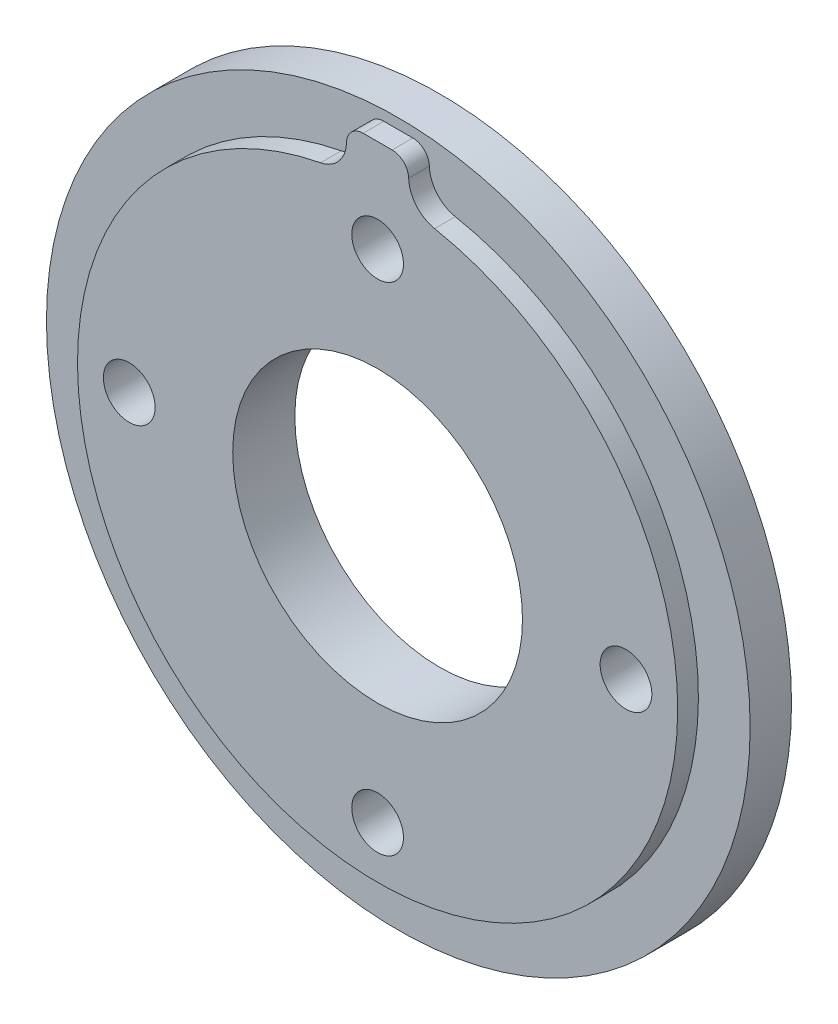
ISO-10303-21;
HEADER;
FILE_DESCRIPTION(('STEP AP214'),'2;1');
FILE_NAME('part.step','',(''),(''),'','','');
FILE_SCHEMA(('AUTOMOTIVE_DESIGN { 1 0 10303 214 1 1 1 1 }'));
ENDSEC;
DATA;
#1=APPLICATION_CONTEXT('core data for automotive mechanical design processes');
#2=APPLICATION_PROTOCOL_DEFINITION('international standard','automotive_design',2000,#1);
#3=PRODUCT_CONTEXT('',#1,'mechanical');
#4=PRODUCT('Part','Part','',(#3));
#5=PRODUCT_RELATED_PRODUCT_CATEGORY('part','',(#4));
#6=PRODUCT_DEFINITION_FORMATION('','',#4);
#7=PRODUCT_DEFINITION_CONTEXT('part definition',#1,'design');
#8=PRODUCT_DEFINITION('design','',#6,#7);
#9=PRODUCT_DEFINITION_SHAPE('','',#8);
#10=(LENGTH_UNIT() NAMED_UNIT(*) SI_UNIT(.MILLI.,.METRE.));
#11=(NAMED_UNIT(*) PLANE_ANGLE_UNIT() SI_UNIT($,.RADIAN.));
#12=(NAMED_UNIT(*) SI_UNIT($,.STERADIAN.) SOLID_ANGLE_UNIT());
#13=UNCERTAINTY_MEASURE_WITH_UNIT(LENGTH_MEASURE(1.E-05),#10,'distance_accuracy_value','');
#14=(GEOMETRIC_REPRESENTATION_CONTEXT(3) GLOBAL_UNCERTAINTY_ASSIGNED_CONTEXT((#13)) GLOBAL_UNIT_ASSIGNED_CONTEXT((#10,
#11,#12)) REPRESENTATION_CONTEXT('',''));
#15=CARTESIAN_POINT('',(0.,0.,0.));
#16=DIRECTION('',(0.,0.,1.));
#17=DIRECTION('',(1.,0.,0.));
#18=AXIS2_PLACEMENT_3D('',#15,#16,#17);
#19=CARTESIAN_POINT('',(0.,0.,2.));
#20=DIRECTION('',(0.,0.,-1.));
#21=DIRECTION('',(-1.,0.,0.));
#22=AXIS2_PLACEMENT_3D('',#19,#20,#21);
#23=CYLINDRICAL_SURFACE('',#22,17.);
#24=CARTESIAN_POINT('',(0.,0.,2.));
#25=DIRECTION('',(0.,0.,1.));
#26=DIRECTION('',(1.,0.,0.));
#27=AXIS2_PLACEMENT_3D('',#24,#25,#26);
#28=CIRCLE('',#27,17.);
#29=CARTESIAN_POINT('',(17.,0.,2.));
#30=VERTEX_POINT('',#29);
#31=EDGE_CURVE('E134',#30,#30,#28,.T.);
#32=ORIENTED_EDGE('',*,*,#31,.F.);
#33=EDGE_LOOP('',(#32));
#34=FACE_BOUND('',#33,.T.);
#35=CARTESIAN_POINT('',(0.,0.,0.));
#36=DIRECTION('',(0.,0.,1.));
#37=DIRECTION('',(1.,0.,0.));
#38=AXIS2_PLACEMENT_3D('',#35,#36,#37);
#39=CIRCLE('',#38,17.);
#40=CARTESIAN_POINT('',(17.,0.,0.));
#41=VERTEX_POINT('',#40);
#42=EDGE_CURVE('E138',#41,#41,#39,.T.);
#43=ORIENTED_EDGE('',*,*,#42,.T.);
#44=EDGE_LOOP('',(#43));
#45=FACE_BOUND('',#44,.T.);
#46=ADVANCED_FACE('F40',(#34,#45),#23,.T.);
#47=CARTESIAN_POINT('',(0.,0.,2.));
#48=DIRECTION('',(0.,0.,1.));
#49=DIRECTION('',(1.,0.,0.));
#50=AXIS2_PLACEMENT_3D('',#47,#48,#49);
#51=PLANE('',#50);
#52=CARTESIAN_POINT('',(0.,0.,2.));
#53=DIRECTION('',(0.,0.,1.));
#54=DIRECTION('',(1.,0.,0.));
#55=AXIS2_PLACEMENT_3D('',#52,#53,#54);
#56=CIRCLE('',#55,14.5);
#57=CARTESIAN_POINT('',(-2.75545171339564,14.2357818842221,2.));
#58=VERTEX_POINT('',#57);
#59=CARTESIAN_POINT('',(2.75545171339564,14.2357818842221,2.));
#60=VERTEX_POINT('',#59);
#61=EDGE_CURVE('E109',#58,#60,#56,.T.);
#62=ORIENTED_EDGE('',*,*,#61,.F.);
#63=CARTESIAN_POINT('',(-3.05,15.7575378787424,2.));
#64=DIRECTION('',(0.,0.,1.));
#65=DIRECTION('',(1.,0.,0.));
#66=AXIS2_PLACEMENT_3D('',#63,#64,#65);
#67=CIRCLE('',#66,1.55);
#68=CARTESIAN_POINT('',(-1.50046466372881,15.7195873629761,2.));
#69=VERTEX_POINT('',#68);
#70=EDGE_CURVE('E94',#58,#69,#67,.T.);
#71=ORIENTED_EDGE('',*,*,#70,.T.);
#72=CARTESIAN_POINT('',(-0.700704490169483,15.7,2.));
#73=DIRECTION('',(0.,0.,1.));
#74=DIRECTION('',(1.,0.,0.));
#75=AXIS2_PLACEMENT_3D('',#72,#73,#74);
#76=CIRCLE('',#75,0.8);
#77=CARTESIAN_POINT('',(-0.700704490169483,16.5,2.));
#78=VERTEX_POINT('',#77);
#79=EDGE_CURVE('E11',#69,#78,#76,.F.);
#80=ORIENTED_EDGE('',*,*,#79,.T.);
#81=DIRECTION('',(1.,0.,0.));
#82=VECTOR('',#81,1.);
#83=CARTESIAN_POINT('',(0.,16.5,2.));
#84=LINE('',#83,#82);
#85=CARTESIAN_POINT('',(0.700704490169483,16.5,2.));
#86=VERTEX_POINT('',#85);
#87=EDGE_CURVE('E120',#78,#86,#84,.T.);
#88=ORIENTED_EDGE('',*,*,#87,.T.);
#89=CARTESIAN_POINT('',(0.700704490169483,15.7,2.));
#90=DIRECTION('',(0.,0.,1.));
#91=DIRECTION('',(1.,0.,0.));
#92=AXIS2_PLACEMENT_3D('',#89,#90,#91);
#93=CIRCLE('',#92,0.8);
#94=CARTESIAN_POINT('',(1.50046466372881,15.7195873629761,2.));
#95=VERTEX_POINT('',#94);
#96=EDGE_CURVE('E49',#86,#95,#93,.F.);
#97=ORIENTED_EDGE('',*,*,#96,.T.);
#98=CARTESIAN_POINT('',(3.05,15.7575378787424,2.));
#99=DIRECTION('',(0.,0.,1.));
#100=DIRECTION('',(1.,0.,0.));
#101=AXIS2_PLACEMENT_3D('',#98,#99,#100);
#102=CIRCLE('',#101,1.55);
#103=EDGE_CURVE('E103',#95,#60,#102,.T.);
#104=ORIENTED_EDGE('',*,*,#103,.T.);
#105=EDGE_LOOP('',(#62,#71,#80,#88,#97,#104));
#106=FACE_BOUND('',#105,.T.);
#107=ORIENTED_EDGE('',*,*,#31,.T.);
#108=EDGE_LOOP('',(#107));
#109=FACE_BOUND('',#108,.T.);
#110=ADVANCED_FACE('F116',(#106,#109),#51,.T.);
#111=CARTESIAN_POINT('',(0.,0.,0.));
#112=DIRECTION('',(0.,0.,1.));
#113=DIRECTION('',(1.,0.,0.));
#114=AXIS2_PLACEMENT_3D('',#111,#112,#113);
#115=PLANE('',#114);
#116=CARTESIAN_POINT('',(0.,12.,0.));
#117=DIRECTION('',(0.,0.,-1.));
#118=DIRECTION('',(-1.,0.,0.));
#119=AXIS2_PLACEMENT_3D('',#116,#117,#118);
#120=CIRCLE('',#119,1.25);
#121=CARTESIAN_POINT('',(-1.25,12.,0.));
#122=VERTEX_POINT('',#121);
#123=EDGE_CURVE('E213',#122,#122,#120,.T.);
#124=ORIENTED_EDGE('',*,*,#123,.F.);
#125=EDGE_LOOP('',(#124));
#126=FACE_BOUND('',#125,.T.);
#127=CARTESIAN_POINT('',(-12.0000000000004,3.53709943211137E-13,0.));
#128=DIRECTION('',(0.,0.,-1.));
#129=DIRECTION('',(-1.,0.,0.));
#130=AXIS2_PLACEMENT_3D('',#127,#128,#129);
#131=CIRCLE('',#130,1.25);
#132=CARTESIAN_POINT('',(-13.2500000000004,3.53709943211137E-13,0.));
#133=VERTEX_POINT('',#132);
#134=EDGE_CURVE('E205',#133,#133,#131,.T.);
#135=ORIENTED_EDGE('',*,*,#134,.F.);
#136=EDGE_LOOP('',(#135));
#137=FACE_BOUND('',#136,.T.);
#138=CARTESIAN_POINT('',(-7.07419886422274E-13,-12.,0.));
#139=DIRECTION('',(0.,0.,-1.));
#140=DIRECTION('',(-1.,0.,0.));
#141=AXIS2_PLACEMENT_3D('',#138,#139,#140);
#142=CIRCLE('',#141,1.25);
#143=CARTESIAN_POINT('',(-1.25000000000071,-12.,0.));
#144=VERTEX_POINT('',#143);
#145=EDGE_CURVE('E197',#144,#144,#142,.T.);
#146=ORIENTED_EDGE('',*,*,#145,.F.);
#147=EDGE_LOOP('',(#146));
#148=FACE_BOUND('',#147,.T.);
#149=CARTESIAN_POINT('',(11.9999999999996,-3.55179519370114E-13,0.));
#150=DIRECTION('',(0.,0.,-1.));
#151=DIRECTION('',(-1.,0.,0.));
#152=AXIS2_PLACEMENT_3D('',#149,#150,#151);
#153=CIRCLE('',#152,1.25);
#154=CARTESIAN_POINT('',(10.7499999999996,-3.55179519370114E-13,0.));
#155=VERTEX_POINT('',#154);
#156=EDGE_CURVE('E189',#155,#155,#153,.T.);
#157=ORIENTED_EDGE('',*,*,#156,.F.);
#158=EDGE_LOOP('',(#157));
#159=FACE_BOUND('',#158,.T.);
#160=CARTESIAN_POINT('',(0.,0.,0.));
#161=DIRECTION('',(0.,0.,1.));
#162=DIRECTION('',(1.,0.,0.));
#163=AXIS2_PLACEMENT_3D('',#160,#161,#162);
#164=CIRCLE('',#163,7.);
#165=CARTESIAN_POINT('',(7.,0.,0.));
#166=VERTEX_POINT('',#165);
#167=EDGE_CURVE('E121',#166,#166,#164,.T.);
#168=ORIENTED_EDGE('',*,*,#167,.T.);
#169=EDGE_LOOP('',(#168));
#170=FACE_BOUND('',#169,.T.);
#171=ORIENTED_EDGE('',*,*,#42,.F.);
#172=EDGE_LOOP('',(#171));
#173=FACE_BOUND('',#172,.T.);
#174=ADVANCED_FACE('F230',(#126,#137,#148,#159,#170,#173),#115,.F.);
#175=CARTESIAN_POINT('',(0.,0.,3.));
#176=DIRECTION('',(0.,0.,-1.));
#177=DIRECTION('',(-1.,0.,0.));
#178=AXIS2_PLACEMENT_3D('',#175,#176,#177);
#179=CYLINDRICAL_SURFACE('',#178,14.5);
#180=CARTESIAN_POINT('',(0.,0.,3.));
#181=DIRECTION('',(0.,0.,1.));
#182=DIRECTION('',(1.,0.,0.));
#183=AXIS2_PLACEMENT_3D('',#180,#181,#182);
#184=CIRCLE('',#183,14.5);
#185=CARTESIAN_POINT('',(-2.75545171339564,14.2357818842221,3.));
#186=VERTEX_POINT('',#185);
#187=CARTESIAN_POINT('',(2.75545171339564,14.2357818842221,3.));
#188=VERTEX_POINT('',#187);
#189=EDGE_CURVE('E112',#186,#188,#184,.T.);
#190=ORIENTED_EDGE('',*,*,#189,.F.);
#191=DIRECTION('',(0.,0.,-1.));
#192=VECTOR('',#191,1.);
#193=CARTESIAN_POINT('',(-2.75545171339564,14.2357818842221,3.));
#194=LINE('',#193,#192);
#195=EDGE_CURVE('E97',#186,#58,#194,.T.);
#196=ORIENTED_EDGE('',*,*,#195,.T.);
#197=ORIENTED_EDGE('',*,*,#61,.T.);
#198=DIRECTION('',(0.,0.,-1.));
#199=VECTOR('',#198,1.);
#200=CARTESIAN_POINT('',(2.75545171339564,14.2357818842221,3.));
#201=LINE('',#200,#199);
#202=EDGE_CURVE('E114',#60,#188,#201,.F.);
#203=ORIENTED_EDGE('',*,*,#202,.T.);
#204=EDGE_LOOP('',(#190,#196,#197,#203));
#205=FACE_BOUND('',#204,.T.);
#206=ADVANCED_FACE('F108',(#205),#179,.T.);
#207=CARTESIAN_POINT('',(0.,16.5,3.));
#208=DIRECTION('',(0.,1.,0.));
#209=DIRECTION('',(0.,0.,1.));
#210=AXIS2_PLACEMENT_3D('',#207,#208,#209);
#211=PLANE('',#210);
#212=DIRECTION('',(1.,0.,0.));
#213=VECTOR('',#212,1.);
#214=CARTESIAN_POINT('',(0.,16.5,3.));
#215=LINE('',#214,#213);
#216=CARTESIAN_POINT('',(-0.700704490169483,16.5,3.));
#217=VERTEX_POINT('',#216);
#218=CARTESIAN_POINT('',(0.700704490169483,16.5,3.));
#219=VERTEX_POINT('',#218);
#220=EDGE_CURVE('E131',#217,#219,#215,.T.);
#221=ORIENTED_EDGE('',*,*,#220,.T.);
#222=DIRECTION('',(0.,0.,1.));
#223=VECTOR('',#222,1.);
#224=CARTESIAN_POINT('',(0.700704490169483,16.5,2.));
#225=LINE('',#224,#223);
#226=EDGE_CURVE('E155',#219,#86,#225,.F.);
#227=ORIENTED_EDGE('',*,*,#226,.T.);
#228=ORIENTED_EDGE('',*,*,#87,.F.);
#229=DIRECTION('',(0.,0.,1.));
#230=VECTOR('',#229,1.);
#231=CARTESIAN_POINT('',(-0.700704490169483,16.5,3.));
#232=LINE('',#231,#230);
#233=EDGE_CURVE('E152',#78,#217,#232,.T.);
#234=ORIENTED_EDGE('',*,*,#233,.T.);
#235=EDGE_LOOP('',(#221,#227,#228,#234));
#236=FACE_BOUND('',#235,.T.);
#237=ADVANCED_FACE('F181',(#236),#211,.T.);
#238=CARTESIAN_POINT('',(0.,0.,3.));
#239=DIRECTION('',(0.,0.,1.));
#240=DIRECTION('',(1.,0.,0.));
#241=AXIS2_PLACEMENT_3D('',#238,#239,#240);
#242=PLANE('',#241);
#243=CARTESIAN_POINT('',(0.,12.,3.));
#244=DIRECTION('',(0.,0.,-1.));
#245=DIRECTION('',(-1.,0.,0.));
#246=AXIS2_PLACEMENT_3D('',#243,#244,#245);
#247=CIRCLE('',#246,1.25);
#248=CARTESIAN_POINT('',(-1.25,12.,3.));
#249=VERTEX_POINT('',#248);
#250=EDGE_CURVE('E187',#249,#249,#247,.T.);
#251=ORIENTED_EDGE('',*,*,#250,.T.);
#252=EDGE_LOOP('',(#251));
#253=FACE_BOUND('',#252,.T.);
#254=CARTESIAN_POINT('',(-12.0000000000004,3.53709943211137E-13,3.));
#255=DIRECTION('',(0.,0.,-1.));
#256=DIRECTION('',(-1.,0.,0.));
#257=AXIS2_PLACEMENT_3D('',#254,#255,#256);
#258=CIRCLE('',#257,1.25);
#259=CARTESIAN_POINT('',(-13.2500000000004,3.53709943211137E-13,3.));
#260=VERTEX_POINT('',#259);
#261=EDGE_CURVE('E209',#260,#260,#258,.T.);
#262=ORIENTED_EDGE('',*,*,#261,.T.);
#263=EDGE_LOOP('',(#262));
#264=FACE_BOUND('',#263,.T.);
#265=CARTESIAN_POINT('',(-7.07419886422274E-13,-12.,3.));
#266=DIRECTION('',(0.,0.,-1.));
#267=DIRECTION('',(-1.,0.,0.));
#268=AXIS2_PLACEMENT_3D('',#265,#266,#267);
#269=CIRCLE('',#268,1.25);
#270=CARTESIAN_POINT('',(-1.25000000000071,-12.,3.));
#271=VERTEX_POINT('',#270);
#272=EDGE_CURVE('E201',#271,#271,#269,.T.);
#273=ORIENTED_EDGE('',*,*,#272,.T.);
#274=EDGE_LOOP('',(#273));
#275=FACE_BOUND('',#274,.T.);
#276=CARTESIAN_POINT('',(11.9999999999996,-3.55179519370114E-13,3.));
#277=DIRECTION('',(0.,0.,-1.));
#278=DIRECTION('',(-1.,0.,0.));
#279=AXIS2_PLACEMENT_3D('',#276,#277,#278);
#280=CIRCLE('',#279,1.25);
#281=CARTESIAN_POINT('',(10.7499999999996,-3.55179519370114E-13,3.));
#282=VERTEX_POINT('',#281);
#283=EDGE_CURVE('E193',#282,#282,#280,.T.);
#284=ORIENTED_EDGE('',*,*,#283,.T.);
#285=EDGE_LOOP('',(#284));
#286=FACE_BOUND('',#285,.T.);
#287=CARTESIAN_POINT('',(0.,0.,3.));
#288=DIRECTION('',(0.,0.,1.));
#289=DIRECTION('',(1.,0.,0.));
#290=AXIS2_PLACEMENT_3D('',#287,#288,#289);
#291=CIRCLE('',#290,7.);
#292=CARTESIAN_POINT('',(7.,0.,3.));
#293=VERTEX_POINT('',#292);
#294=EDGE_CURVE('E128',#293,#293,#291,.T.);
#295=ORIENTED_EDGE('',*,*,#294,.F.);
#296=EDGE_LOOP('',(#295));
#297=FACE_BOUND('',#296,.T.);
#298=CARTESIAN_POINT('',(3.05,15.7575378787424,3.));
#299=DIRECTION('',(0.,0.,1.));
#300=DIRECTION('',(1.,0.,0.));
#301=AXIS2_PLACEMENT_3D('',#298,#299,#300);
#302=CIRCLE('',#301,1.55);
#303=CARTESIAN_POINT('',(1.50046466372881,15.7195873629761,3.));
#304=VERTEX_POINT('',#303);
#305=EDGE_CURVE('E148',#188,#304,#302,.F.);
#306=ORIENTED_EDGE('',*,*,#305,.T.);
#307=CARTESIAN_POINT('',(0.700704490169483,15.7,3.));
#308=DIRECTION('',(0.,0.,1.));
#309=DIRECTION('',(1.,0.,0.));
#310=AXIS2_PLACEMENT_3D('',#307,#308,#309);
#311=CIRCLE('',#310,0.8);
#312=EDGE_CURVE('E164',#304,#219,#311,.T.);
#313=ORIENTED_EDGE('',*,*,#312,.T.);
#314=ORIENTED_EDGE('',*,*,#220,.F.);
#315=CARTESIAN_POINT('',(-0.700704490169483,15.7,3.));
#316=DIRECTION('',(0.,0.,1.));
#317=DIRECTION('',(1.,0.,0.));
#318=AXIS2_PLACEMENT_3D('',#315,#316,#317);
#319=CIRCLE('',#318,0.8);
#320=CARTESIAN_POINT('',(-1.50046466372881,15.7195873629761,3.));
#321=VERTEX_POINT('',#320);
#322=EDGE_CURVE('E62',#217,#321,#319,.T.);
#323=ORIENTED_EDGE('',*,*,#322,.T.);
#324=CARTESIAN_POINT('',(-3.05,15.7575378787424,3.));
#325=DIRECTION('',(0.,0.,1.));
#326=DIRECTION('',(1.,0.,0.));
#327=AXIS2_PLACEMENT_3D('',#324,#325,#326);
#328=CIRCLE('',#327,1.55);
#329=EDGE_CURVE('E102',#321,#186,#328,.F.);
#330=ORIENTED_EDGE('',*,*,#329,.T.);
#331=ORIENTED_EDGE('',*,*,#189,.T.);
#332=EDGE_LOOP('',(#306,#313,#314,#323,#330,#331));
#333=FACE_BOUND('',#332,.T.);
#334=ADVANCED_FACE('F179',(#253,#264,#275,#286,#297,#333),#242,.T.);
#335=CARTESIAN_POINT('',(-3.05,15.7575378787424,3.));
#336=DIRECTION('',(0.,0.,-1.));
#337=DIRECTION('',(-1.,0.,0.));
#338=AXIS2_PLACEMENT_3D('',#335,#336,#337);
#339=CYLINDRICAL_SURFACE('',#338,1.55);
#340=ORIENTED_EDGE('',*,*,#329,.F.);
#341=DIRECTION('',(0.,0.,-1.));
#342=VECTOR('',#341,1.);
#343=CARTESIAN_POINT('',(-1.50046466372881,15.7195873629761,3.));
#344=LINE('',#343,#342);
#345=EDGE_CURVE('E98',#321,#69,#344,.T.);
#346=ORIENTED_EDGE('',*,*,#345,.T.);
#347=ORIENTED_EDGE('',*,*,#70,.F.);
#348=ORIENTED_EDGE('',*,*,#195,.F.);
#349=EDGE_LOOP('',(#340,#346,#347,#348));
#350=FACE_BOUND('',#349,.T.);
#351=ADVANCED_FACE('F96',(#350),#339,.F.);
#352=CARTESIAN_POINT('',(3.05,15.7575378787424,3.));
#353=DIRECTION('',(0.,0.,-1.));
#354=DIRECTION('',(-1.,0.,0.));
#355=AXIS2_PLACEMENT_3D('',#352,#353,#354);
#356=CYLINDRICAL_SURFACE('',#355,1.55);
#357=ORIENTED_EDGE('',*,*,#103,.F.);
#358=DIRECTION('',(0.,0.,-1.));
#359=VECTOR('',#358,1.);
#360=CARTESIAN_POINT('',(1.50046466372881,15.7195873629761,3.));
#361=LINE('',#360,#359);
#362=EDGE_CURVE('E159',#95,#304,#361,.F.);
#363=ORIENTED_EDGE('',*,*,#362,.T.);
#364=ORIENTED_EDGE('',*,*,#305,.F.);
#365=ORIENTED_EDGE('',*,*,#202,.F.);
#366=EDGE_LOOP('',(#357,#363,#364,#365));
#367=FACE_BOUND('',#366,.T.);
#368=ADVANCED_FACE('F174',(#367),#356,.F.);
#369=CARTESIAN_POINT('',(0.700704490169483,15.7,3.));
#370=DIRECTION('',(0.,0.,-1.));
#371=DIRECTION('',(-1.,0.,0.));
#372=AXIS2_PLACEMENT_3D('',#369,#370,#371);
#373=CYLINDRICAL_SURFACE('',#372,0.8);
#374=ORIENTED_EDGE('',*,*,#312,.F.);
#375=ORIENTED_EDGE('',*,*,#362,.F.);
#376=ORIENTED_EDGE('',*,*,#96,.F.);
#377=ORIENTED_EDGE('',*,*,#226,.F.);
#378=EDGE_LOOP('',(#374,#375,#376,#377));
#379=FACE_BOUND('',#378,.T.);
#380=ADVANCED_FACE('F177',(#379),#373,.T.);
#381=CARTESIAN_POINT('',(-0.700704490169483,15.7,3.));
#382=DIRECTION('',(0.,0.,-1.));
#383=DIRECTION('',(-1.,0.,0.));
#384=AXIS2_PLACEMENT_3D('',#381,#382,#383);
#385=CYLINDRICAL_SURFACE('',#384,0.8);
#386=ORIENTED_EDGE('',*,*,#322,.F.);
#387=ORIENTED_EDGE('',*,*,#233,.F.);
#388=ORIENTED_EDGE('',*,*,#79,.F.);
#389=ORIENTED_EDGE('',*,*,#345,.F.);
#390=EDGE_LOOP('',(#386,#387,#388,#389));
#391=FACE_BOUND('',#390,.T.);
#392=ADVANCED_FACE('F42',(#391),#385,.T.);
#393=CARTESIAN_POINT('',(0.,0.,0.));
#394=DIRECTION('',(0.,0.,1.));
#395=DIRECTION('',(1.,0.,0.));
#396=AXIS2_PLACEMENT_3D('',#393,#394,#395);
#397=CYLINDRICAL_SURFACE('',#396,7.);
#398=ORIENTED_EDGE('',*,*,#167,.F.);
#399=EDGE_LOOP('',(#398));
#400=FACE_BOUND('',#399,.T.);
#401=ORIENTED_EDGE('',*,*,#294,.T.);
#402=EDGE_LOOP('',(#401));
#403=FACE_BOUND('',#402,.T.);
#404=ADVANCED_FACE('F260',(#400,#403),#397,.F.);
#405=CARTESIAN_POINT('',(11.9999999999996,-3.55179519370114E-13,3.));
#406=DIRECTION('',(0.,0.,-1.));
#407=DIRECTION('',(-1.,0.,0.));
#408=AXIS2_PLACEMENT_3D('',#405,#406,#407);
#409=CYLINDRICAL_SURFACE('',#408,1.25);
#410=ORIENTED_EDGE('',*,*,#283,.F.);
#411=EDGE_LOOP('',(#410));
#412=FACE_BOUND('',#411,.T.);
#413=ORIENTED_EDGE('',*,*,#156,.T.);
#414=EDGE_LOOP('',(#413));
#415=FACE_BOUND('',#414,.T.);
#416=ADVANCED_FACE('F264',(#412,#415),#409,.F.);
#417=CARTESIAN_POINT('',(-7.07419886422274E-13,-12.,3.));
#418=DIRECTION('',(0.,0.,-1.));
#419=DIRECTION('',(-1.,0.,0.));
#420=AXIS2_PLACEMENT_3D('',#417,#418,#419);
#421=CYLINDRICAL_SURFACE('',#420,1.25);
#422=ORIENTED_EDGE('',*,*,#272,.F.);
#423=EDGE_LOOP('',(#422));
#424=FACE_BOUND('',#423,.T.);
#425=ORIENTED_EDGE('',*,*,#145,.T.);
#426=EDGE_LOOP('',(#425));
#427=FACE_BOUND('',#426,.T.);
#428=ADVANCED_FACE('F270',(#424,#427),#421,.F.);
#429=CARTESIAN_POINT('',(-12.0000000000004,3.53709943211137E-13,3.));
#430=DIRECTION('',(0.,0.,-1.));
#431=DIRECTION('',(-1.,0.,0.));
#432=AXIS2_PLACEMENT_3D('',#429,#430,#431);
#433=CYLINDRICAL_SURFACE('',#432,1.25);
#434=ORIENTED_EDGE('',*,*,#261,.F.);
#435=EDGE_LOOP('',(#434));
#436=FACE_BOUND('',#435,.T.);
#437=ORIENTED_EDGE('',*,*,#134,.T.);
#438=EDGE_LOOP('',(#437));
#439=FACE_BOUND('',#438,.T.);
#440=ADVANCED_FACE('F226',(#436,#439),#433,.F.);
#441=CARTESIAN_POINT('',(0.,12.,3.));
#442=DIRECTION('',(0.,0.,-1.));
#443=DIRECTION('',(-1.,0.,0.));
#444=AXIS2_PLACEMENT_3D('',#441,#442,#443);
#445=CYLINDRICAL_SURFACE('',#444,1.25);
#446=ORIENTED_EDGE('',*,*,#250,.F.);
#447=EDGE_LOOP('',(#446));
#448=FACE_BOUND('',#447,.T.);
#449=ORIENTED_EDGE('',*,*,#123,.T.);
#450=EDGE_LOOP('',(#449));
#451=FACE_BOUND('',#450,.T.);
#452=ADVANCED_FACE('F223',(#448,#451),#445,.F.);
#453=CLOSED_SHELL('',(#46,#110,#174,#206,#237,#334,#351,#368,#380,#392,#404,#416,#428,#440,#452));
#454=MANIFOLD_SOLID_BREP('B2',#453);
#455=ADVANCED_BREP_SHAPE_REPRESENTATION('',(#18,#454),#14);
#456=SHAPE_DEFINITION_REPRESENTATION(#9,#455);
ENDSEC;
END-ISO-10303-21;
